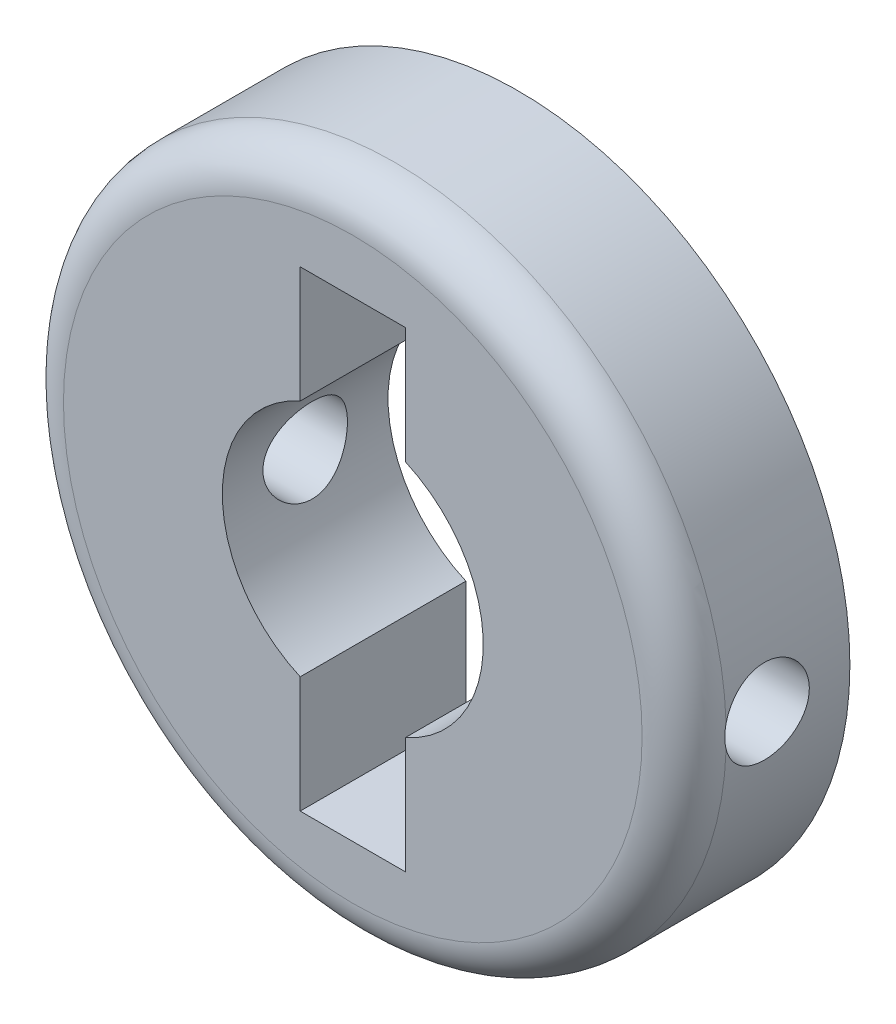
ISO-10303-21;
HEADER;
FILE_DESCRIPTION(('STEP AP214'),'2;1');
FILE_NAME('part.step','',(''),(''),'','','');
FILE_SCHEMA(('AUTOMOTIVE_DESIGN { 1 0 10303 214 1 1 1 1 }'));
ENDSEC;
DATA;
#1=APPLICATION_CONTEXT('core data for automotive mechanical design processes');
#2=APPLICATION_PROTOCOL_DEFINITION('international standard','automotive_design',2000,#1);
#3=PRODUCT_CONTEXT('',#1,'mechanical');
#4=PRODUCT('Part','Part','',(#3));
#5=PRODUCT_RELATED_PRODUCT_CATEGORY('part','',(#4));
#6=PRODUCT_DEFINITION_FORMATION('','',#4);
#7=PRODUCT_DEFINITION_CONTEXT('part definition',#1,'design');
#8=PRODUCT_DEFINITION('design','',#6,#7);
#9=PRODUCT_DEFINITION_SHAPE('','',#8);
#10=(LENGTH_UNIT() NAMED_UNIT(*) SI_UNIT(.MILLI.,.METRE.));
#11=(NAMED_UNIT(*) PLANE_ANGLE_UNIT() SI_UNIT($,.RADIAN.));
#12=(NAMED_UNIT(*) SI_UNIT($,.STERADIAN.) SOLID_ANGLE_UNIT());
#13=UNCERTAINTY_MEASURE_WITH_UNIT(LENGTH_MEASURE(1.E-05),#10,'distance_accuracy_value','');
#14=(GEOMETRIC_REPRESENTATION_CONTEXT(3) GLOBAL_UNCERTAINTY_ASSIGNED_CONTEXT((#13)) GLOBAL_UNIT_ASSIGNED_CONTEXT((#10,
#11,#12)) REPRESENTATION_CONTEXT('',''));
#15=CARTESIAN_POINT('',(0.,0.,0.));
#16=DIRECTION('',(0.,0.,1.));
#17=DIRECTION('',(1.,0.,0.));
#18=AXIS2_PLACEMENT_3D('',#15,#16,#17);
#19=CARTESIAN_POINT('',(0.,0.,2.5));
#20=DIRECTION('',(0.,0.,1.));
#21=DIRECTION('',(1.,0.,0.));
#22=AXIS2_PLACEMENT_3D('',#19,#20,#21);
#23=PLANE('',#22);
#24=CARTESIAN_POINT('',(0.,0.,2.5));
#25=DIRECTION('',(0.,0.,1.));
#26=DIRECTION('',(1.,0.,0.));
#27=AXIS2_PLACEMENT_3D('',#24,#25,#26);
#28=CIRCLE('',#27,8.73);
#29=CARTESIAN_POINT('',(8.73,0.,2.5));
#30=VERTEX_POINT('',#29);
#31=EDGE_CURVE('E188',#30,#30,#28,.T.);
#32=ORIENTED_EDGE('',*,*,#31,.T.);
#33=EDGE_LOOP('',(#32));
#34=FACE_BOUND('',#33,.T.);
#35=DIRECTION('',(0.,-1.,0.));
#36=VECTOR('',#35,1.);
#37=CARTESIAN_POINT('',(-1.5875,3.60275071993609,2.5));
#38=LINE('',#37,#36);
#39=CARTESIAN_POINT('',(-1.5875,7.112,2.5));
#40=VERTEX_POINT('',#39);
#41=CARTESIAN_POINT('',(-1.5875,3.60275071993609,2.5));
#42=VERTEX_POINT('',#41);
#43=EDGE_CURVE('E124',#40,#42,#38,.T.);
#44=ORIENTED_EDGE('',*,*,#43,.F.);
#45=DIRECTION('',(-1.,0.,0.));
#46=VECTOR('',#45,1.);
#47=CARTESIAN_POINT('',(1.5875,7.112,2.5));
#48=LINE('',#47,#46);
#49=CARTESIAN_POINT('',(1.5875,7.112,2.5));
#50=VERTEX_POINT('',#49);
#51=EDGE_CURVE('E114',#50,#40,#48,.T.);
#52=ORIENTED_EDGE('',*,*,#51,.F.);
#53=DIRECTION('',(0.,1.,0.));
#54=VECTOR('',#53,1.);
#55=CARTESIAN_POINT('',(1.5875,3.60275071993609,2.5));
#56=LINE('',#55,#54);
#57=CARTESIAN_POINT('',(1.5875,3.60275071993609,2.5));
#58=VERTEX_POINT('',#57);
#59=EDGE_CURVE('E151',#58,#50,#56,.T.);
#60=ORIENTED_EDGE('',*,*,#59,.F.);
#61=CARTESIAN_POINT('',(0.,0.,2.5));
#62=DIRECTION('',(0.,0.,1.));
#63=DIRECTION('',(1.,0.,0.));
#64=AXIS2_PLACEMENT_3D('',#61,#62,#63);
#65=CIRCLE('',#64,3.937);
#66=CARTESIAN_POINT('',(1.5875,-3.60275071993609,2.5));
#67=VERTEX_POINT('',#66);
#68=EDGE_CURVE('E148',#67,#58,#65,.T.);
#69=ORIENTED_EDGE('',*,*,#68,.F.);
#70=DIRECTION('',(0.,1.,0.));
#71=VECTOR('',#70,1.);
#72=CARTESIAN_POINT('',(1.5875,-3.60275071993609,2.5));
#73=LINE('',#72,#71);
#74=CARTESIAN_POINT('',(1.5875,-7.112,2.5));
#75=VERTEX_POINT('',#74);
#76=EDGE_CURVE('E146',#75,#67,#73,.T.);
#77=ORIENTED_EDGE('',*,*,#76,.F.);
#78=DIRECTION('',(1.,0.,0.));
#79=VECTOR('',#78,1.);
#80=CARTESIAN_POINT('',(1.5875,-7.112,2.5));
#81=LINE('',#80,#79);
#82=CARTESIAN_POINT('',(-1.5875,-7.112,2.5));
#83=VERTEX_POINT('',#82);
#84=EDGE_CURVE('E144',#83,#75,#81,.T.);
#85=ORIENTED_EDGE('',*,*,#84,.F.);
#86=DIRECTION('',(0.,-1.,0.));
#87=VECTOR('',#86,1.);
#88=CARTESIAN_POINT('',(-1.5875,-3.60275071993609,2.5));
#89=LINE('',#88,#87);
#90=CARTESIAN_POINT('',(-1.5875,-3.60275071993609,2.5));
#91=VERTEX_POINT('',#90);
#92=EDGE_CURVE('E139',#91,#83,#89,.T.);
#93=ORIENTED_EDGE('',*,*,#92,.F.);
#94=CARTESIAN_POINT('',(0.,0.,2.5));
#95=DIRECTION('',(0.,0.,1.));
#96=DIRECTION('',(1.,0.,0.));
#97=AXIS2_PLACEMENT_3D('',#94,#95,#96);
#98=CIRCLE('',#97,3.937);
#99=EDGE_CURVE('E137',#42,#91,#98,.T.);
#100=ORIENTED_EDGE('',*,*,#99,.F.);
#101=EDGE_LOOP('',(#44,#52,#60,#69,#77,#85,#93,#100));
#102=FACE_BOUND('',#101,.T.);
#103=ADVANCED_FACE('F32',(#34,#102),#23,.T.);
#104=CARTESIAN_POINT('',(0.,0.,-2.5));
#105=DIRECTION('',(0.,0.,1.));
#106=DIRECTION('',(1.,0.,0.));
#107=AXIS2_PLACEMENT_3D('',#104,#105,#106);
#108=PLANE('',#107);
#109=CARTESIAN_POINT('',(0.,0.,-2.5));
#110=DIRECTION('',(0.,0.,1.));
#111=DIRECTION('',(1.,0.,0.));
#112=AXIS2_PLACEMENT_3D('',#109,#110,#111);
#113=CIRCLE('',#112,10.);
#114=CARTESIAN_POINT('',(10.,0.,-2.5));
#115=VERTEX_POINT('',#114);
#116=EDGE_CURVE('E132',#115,#115,#113,.T.);
#117=ORIENTED_EDGE('',*,*,#116,.F.);
#118=EDGE_LOOP('',(#117));
#119=FACE_BOUND('',#118,.T.);
#120=DIRECTION('',(-1.,0.,0.));
#121=VECTOR('',#120,1.);
#122=CARTESIAN_POINT('',(1.5875,7.112,-2.5));
#123=LINE('',#122,#121);
#124=CARTESIAN_POINT('',(1.5875,7.112,-2.5));
#125=VERTEX_POINT('',#124);
#126=CARTESIAN_POINT('',(-1.5875,7.112,-2.5));
#127=VERTEX_POINT('',#126);
#128=EDGE_CURVE('E153',#125,#127,#123,.T.);
#129=ORIENTED_EDGE('',*,*,#128,.T.);
#130=DIRECTION('',(0.,-1.,0.));
#131=VECTOR('',#130,1.);
#132=CARTESIAN_POINT('',(-1.5875,3.60275071993609,-2.5));
#133=LINE('',#132,#131);
#134=CARTESIAN_POINT('',(-1.5875,3.60275071993609,-2.5));
#135=VERTEX_POINT('',#134);
#136=EDGE_CURVE('E131',#127,#135,#133,.T.);
#137=ORIENTED_EDGE('',*,*,#136,.T.);
#138=CARTESIAN_POINT('',(0.,0.,-2.5));
#139=DIRECTION('',(0.,0.,1.));
#140=DIRECTION('',(1.,0.,0.));
#141=AXIS2_PLACEMENT_3D('',#138,#139,#140);
#142=CIRCLE('',#141,3.937);
#143=CARTESIAN_POINT('',(-1.5875,-3.60275071993609,-2.5));
#144=VERTEX_POINT('',#143);
#145=EDGE_CURVE('E157',#135,#144,#142,.T.);
#146=ORIENTED_EDGE('',*,*,#145,.T.);
#147=DIRECTION('',(0.,-1.,0.));
#148=VECTOR('',#147,1.);
#149=CARTESIAN_POINT('',(-1.5875,-3.60275071993609,-2.5));
#150=LINE('',#149,#148);
#151=CARTESIAN_POINT('',(-1.5875,-7.112,-2.5));
#152=VERTEX_POINT('',#151);
#153=EDGE_CURVE('E160',#144,#152,#150,.T.);
#154=ORIENTED_EDGE('',*,*,#153,.T.);
#155=DIRECTION('',(1.,0.,0.));
#156=VECTOR('',#155,1.);
#157=CARTESIAN_POINT('',(1.5875,-7.112,-2.5));
#158=LINE('',#157,#156);
#159=CARTESIAN_POINT('',(1.5875,-7.112,-2.5));
#160=VERTEX_POINT('',#159);
#161=EDGE_CURVE('E163',#152,#160,#158,.T.);
#162=ORIENTED_EDGE('',*,*,#161,.T.);
#163=DIRECTION('',(0.,1.,0.));
#164=VECTOR('',#163,1.);
#165=CARTESIAN_POINT('',(1.5875,-3.60275071993609,-2.5));
#166=LINE('',#165,#164);
#167=CARTESIAN_POINT('',(1.5875,-3.60275071993609,-2.5));
#168=VERTEX_POINT('',#167);
#169=EDGE_CURVE('E166',#160,#168,#166,.T.);
#170=ORIENTED_EDGE('',*,*,#169,.T.);
#171=CARTESIAN_POINT('',(0.,0.,-2.5));
#172=DIRECTION('',(0.,0.,1.));
#173=DIRECTION('',(1.,0.,0.));
#174=AXIS2_PLACEMENT_3D('',#171,#172,#173);
#175=CIRCLE('',#174,3.937);
#176=CARTESIAN_POINT('',(1.5875,3.60275071993609,-2.5));
#177=VERTEX_POINT('',#176);
#178=EDGE_CURVE('E169',#168,#177,#175,.T.);
#179=ORIENTED_EDGE('',*,*,#178,.T.);
#180=DIRECTION('',(0.,1.,0.));
#181=VECTOR('',#180,1.);
#182=CARTESIAN_POINT('',(1.5875,3.60275071993609,-2.5));
#183=LINE('',#182,#181);
#184=EDGE_CURVE('E125',#177,#125,#183,.T.);
#185=ORIENTED_EDGE('',*,*,#184,.T.);
#186=EDGE_LOOP('',(#129,#137,#146,#154,#162,#170,#179,#185));
#187=FACE_BOUND('',#186,.T.);
#188=ADVANCED_FACE('F244',(#119,#187),#108,.F.);
#189=CARTESIAN_POINT('',(0.,0.,2.5));
#190=DIRECTION('',(0.,0.,-1.));
#191=DIRECTION('',(-1.,0.,0.));
#192=AXIS2_PLACEMENT_3D('',#189,#190,#191);
#193=CYLINDRICAL_SURFACE('',#192,10.);
#194=CARTESIAN_POINT('',(-10.,0.,-1.275));
#195=CARTESIAN_POINT('',(-9.99999898900905,0.0713069805486591,-1.27499697797855));
#196=CARTESIAN_POINT('',(-9.99922924783354,0.142658227813307,-1.26899784548031));
#197=CARTESIAN_POINT('',(-9.99623264213217,0.283374441484481,-1.24516129443431));
#198=CARTESIAN_POINT('',(-9.99400426560893,0.352737268766622,-1.22731159150624));
#199=CARTESIAN_POINT('',(-9.98834137101106,0.487419180533232,-1.18030904834373));
#200=CARTESIAN_POINT('',(-9.98490767419184,0.552740982848698,-1.15116390295317));
#201=CARTESIAN_POINT('',(-9.97721580740441,0.677554145862685,-1.08241481650949));
#202=CARTESIAN_POINT('',(-9.97295777640154,0.737046486742956,-1.04281263788257));
#203=CARTESIAN_POINT('',(-9.96406524675019,0.848864327094692,-0.954031627322279));
#204=CARTESIAN_POINT('',(-9.95942893703471,0.901151685479557,-0.904804934010639));
#205=CARTESIAN_POINT('',(-9.95031695365,0.996746776968978,-0.798275048334957));
#206=CARTESIAN_POINT('',(-9.94584128826959,1.04005404727433,-0.740971439973291));
#207=CARTESIAN_POINT('',(-9.93753954596834,1.11660231342159,-0.619665690952453));
#208=CARTESIAN_POINT('',(-9.93371580295591,1.14980746269953,-0.55564075633708));
#209=CARTESIAN_POINT('',(-9.92717481478011,1.20497997499278,-0.4228663327161));
#210=CARTESIAN_POINT('',(-9.92445752599503,1.22694778104649,-0.354117030092527));
#211=CARTESIAN_POINT('',(-9.92045445625584,1.25890587413019,-0.214241798782247));
#212=CARTESIAN_POINT('',(-9.91916097019215,1.26896065302708,-0.143130829293696));
#213=CARTESIAN_POINT('',(-9.91812839760472,1.27700685454378,-0.000219965706401109));
#214=CARTESIAN_POINT('',(-9.91838924613034,1.27499878123146,0.071579899480426));
#215=CARTESIAN_POINT('',(-9.92042881906909,1.25902919836005,0.213380403993893));
#216=CARTESIAN_POINT('',(-9.92219851323609,1.24513880133326,0.28338920038705));
#217=CARTESIAN_POINT('',(-9.92704229069485,1.2059098549359,0.420074007332438));
#218=CARTESIAN_POINT('',(-9.93011640138931,1.18057106506112,0.486749947836406));
#219=CARTESIAN_POINT('',(-9.93723285099178,1.11908840190083,0.615096855854847));
#220=CARTESIAN_POINT('',(-9.94127794592848,1.0829136983135,0.676752895526141));
#221=CARTESIAN_POINT('',(-9.94987846550756,1.0008081207522,0.79314621012636));
#222=CARTESIAN_POINT('',(-9.95443391442528,0.954876782603902,0.847883155679958));
#223=CARTESIAN_POINT('',(-9.96358197658719,0.854167995700556,0.949297204865434));
#224=CARTESIAN_POINT('',(-9.96817462136311,0.799329265711963,0.995913472158784));
#225=CARTESIAN_POINT('',(-9.97684894799018,0.682573166986681,1.07928897096873));
#226=CARTESIAN_POINT('',(-9.98093062858055,0.620655780784414,1.11604817816368));
#227=CARTESIAN_POINT('',(-9.98812581159269,0.491452526058853,1.17866642593481));
#228=CARTESIAN_POINT('',(-9.9912389683406,0.42416475154302,1.20452157593427));
#229=CARTESIAN_POINT('',(-9.99614322590008,0.286154206703742,1.2445490595542));
#230=CARTESIAN_POINT('',(-9.99793439112089,0.215431603908774,1.25872196235361));
#231=CARTESIAN_POINT('',(-9.99998446286045,0.0730848890533081,1.27490359799768));
#232=CARTESIAN_POINT('',(-10.0002539236369,0.00147044803292541,1.27699612036947));
#233=CARTESIAN_POINT('',(-9.99925874312059,-0.141088112456314,1.2691788358716));
#234=CARTESIAN_POINT('',(-9.99799413584901,-0.212032246755497,1.25926929517345));
#235=CARTESIAN_POINT('',(-9.99407948503002,-0.350988509681615,1.22779879492626));
#236=CARTESIAN_POINT('',(-9.99143420260153,-0.419009850253013,1.20627786752556));
#237=CARTESIAN_POINT('',(-9.98505430711499,-0.550478067403917,1.15223716900696));
#238=CARTESIAN_POINT('',(-9.98131965571461,-0.613924782873023,1.11971701074446));
#239=CARTESIAN_POINT('',(-9.9731509550182,-0.734816409736119,1.04439882264762));
#240=CARTESIAN_POINT('',(-9.96871326764595,-0.79222736312898,1.00154668893418));
#241=CARTESIAN_POINT('',(-9.95964607645321,-0.8990720945148,0.906857394221863));
#242=CARTESIAN_POINT('',(-9.95501656470518,-0.94850554240706,0.855019861600713));
#243=CARTESIAN_POINT('',(-9.94605485241221,-1.03829001597882,0.743461787929181));
#244=CARTESIAN_POINT('',(-9.94172457787171,-1.07858544038074,0.683696320349539));
#245=CARTESIAN_POINT('',(-9.93388353426127,-1.14856569467084,0.558196517882709));
#246=CARTESIAN_POINT('',(-9.93037274820726,-1.17825074446811,0.492462306738243));
#247=CARTESIAN_POINT('',(-9.92458138375427,-1.22607793517766,0.357069116795437));
#248=CARTESIAN_POINT('',(-9.92229748747524,-1.24425123146653,0.287421291523409));
#249=CARTESIAN_POINT('',(-9.91920904111565,-1.26863927281101,0.146031489717073));
#250=CARTESIAN_POINT('',(-9.91840441920459,-1.27485459852161,0.0742896150373353));
#251=CARTESIAN_POINT('',(-9.9183677729374,-1.27513932373651,-0.0686985515129803));
#252=CARTESIAN_POINT('',(-9.9191244380328,-1.26929607999485,-0.139944682277638));
#253=CARTESIAN_POINT('',(-9.92210076718944,-1.24581472558366,-0.280433285345764));
#254=CARTESIAN_POINT('',(-9.92432043120827,-1.22817661525598,-0.349675757707303));
#255=CARTESIAN_POINT('',(-9.92996911718717,-1.18163386105255,-0.484178827192298));
#256=CARTESIAN_POINT('',(-9.93339766837658,-1.15273360247657,-0.549440962769689));
#257=CARTESIAN_POINT('',(-9.94107857339484,-1.0844955146534,-0.674203543399463));
#258=CARTESIAN_POINT('',(-9.94533093919083,-1.04515753377961,-0.733703904734617));
#259=CARTESIAN_POINT('',(-9.95421722928982,-0.956837148581513,-0.845700266674065));
#260=CARTESIAN_POINT('',(-9.95885359819787,-0.907789667172023,-0.898144757314406));
#261=CARTESIAN_POINT('',(-9.96796401397538,-0.801578592860974,-0.994092054393632));
#262=CARTESIAN_POINT('',(-9.97243802237438,-0.744413092000531,-1.03759275289427));
#263=CARTESIAN_POINT('',(-9.98073922773195,-0.623328718537295,-1.11456486983362));
#264=CARTESIAN_POINT('',(-9.98456379789354,-0.55938404277058,-1.14799596217558));
#265=CARTESIAN_POINT('',(-9.99110868721096,-0.426774569315059,-1.20359737207436));
#266=CARTESIAN_POINT('',(-9.99383020045368,-0.358114970350297,-1.22577987308476));
#267=CARTESIAN_POINT('',(-9.99720946932226,-0.240920269612237,-1.25296998562738));
#268=CARTESIAN_POINT('',(-9.99825079504399,-0.193122868681685,-1.26121929976254));
#269=CARTESIAN_POINT('',(-9.99964640120901,-0.0968904554644047,-1.27223531238636));
#270=CARTESIAN_POINT('',(-10.0000006870017,-0.0484554481451583,-1.27500205356338));
#271=CARTESIAN_POINT('',(-10.,0.,-1.275));
#272=B_SPLINE_CURVE_WITH_KNOTS('',3,(#194,#195,#196,#197,#198,#199,#200,#201,#202,#203,#204,
#205,#206,#207,#208,#209,#210,#211,#212,#213,#214,#215,#216,#217,#218,#219,#220,#221,#222,#223,
#224,#225,#226,#227,#228,#229,#230,#231,#232,#233,#234,#235,#236,#237,#238,#239,#240,#241,#242,
#243,#244,#245,#246,#247,#248,#249,#250,#251,#252,#253,#254,#255,#256,#257,#258,#259,#260,#261,
#262,#263,#264,#265,#266,#267,#268,#269,#270,#271),.UNSPECIFIED.,.T.,.F.,(4,2,2,2,2,2,2,2,2,2,2,
2,2,2,2,2,2,2,2,2,2,2,2,2,2,2,2,2,2,2,2,2,2,2,2,2,2,2,4),(0.,0.213743942986407,
0.427709801042754,0.641530153687137,0.855314492070391,1.07019030756699,1.28507719418589,
1.50071792744131,1.71635015828748,1.93080963875363,2.14526015770868,2.3584361553852,
2.57161663160371,2.78540950426986,2.99921255046427,3.21455420323894,3.42989638735001,
3.64531534086124,3.86072379817436,4.07463637031165,4.28854419856527,4.50171921374736,
4.7149017329222,4.92922581068809,5.1435587546838,5.35916278595556,5.57476234839047,
5.78977589133864,6.00477899339806,6.21823000200924,6.43168100443406,6.64504897538037,
6.85842004604822,7.07327283701176,7.28817620814823,7.5039291047754,7.7194478156189,
7.86469501454714,8.00994108254818),.UNSPECIFIED.);
#273=CARTESIAN_POINT('',(-9.99436216073842,-0.335745439283992,1.23));
#274=VERTEX_POINT('',#273);
#275=CARTESIAN_POINT('',(-9.99436216073842,0.335745439283991,1.23));
#276=VERTEX_POINT('',#275);
#277=EDGE_CURVE('E155',#274,#276,#272,.T.);
#278=ORIENTED_EDGE('',*,*,#277,.T.);
#279=CARTESIAN_POINT('',(0.,0.,1.23));
#280=DIRECTION('',(0.,0.,1.));
#281=DIRECTION('',(1.,0.,0.));
#282=AXIS2_PLACEMENT_3D('',#279,#280,#281);
#283=CIRCLE('',#282,10.);
#284=CARTESIAN_POINT('',(9.99436216073842,0.335745439283992,1.23));
#285=VERTEX_POINT('',#284);
#286=EDGE_CURVE('E231',#276,#285,#283,.F.);
#287=ORIENTED_EDGE('',*,*,#286,.T.);
#288=CARTESIAN_POINT('',(10.,0.,-1.275));
#289=CARTESIAN_POINT('',(9.99999898900905,-0.0713069805486591,-1.27499697797855));
#290=CARTESIAN_POINT('',(9.99922924783354,-0.142658227813307,-1.26899784548031));
#291=CARTESIAN_POINT('',(9.99623264213217,-0.283374441484481,-1.24516129443431));
#292=CARTESIAN_POINT('',(9.99400426560893,-0.352737268766622,-1.22731159150624));
#293=CARTESIAN_POINT('',(9.98834137101106,-0.487419180533232,-1.18030904834373));
#294=CARTESIAN_POINT('',(9.98490767419184,-0.552740982848698,-1.15116390295317));
#295=CARTESIAN_POINT('',(9.97721580740441,-0.677554145862685,-1.08241481650949));
#296=CARTESIAN_POINT('',(9.97295777640154,-0.737046486742956,-1.04281263788257));
#297=CARTESIAN_POINT('',(9.96406524675019,-0.848864327094692,-0.954031627322279));
#298=CARTESIAN_POINT('',(9.95942893703471,-0.901151685479557,-0.904804934010639));
#299=CARTESIAN_POINT('',(9.95031695365,-0.996746776968978,-0.798275048334957));
#300=CARTESIAN_POINT('',(9.94584128826959,-1.04005404727433,-0.740971439973291));
#301=CARTESIAN_POINT('',(9.93753954596834,-1.11660231342159,-0.619665690952453));
#302=CARTESIAN_POINT('',(9.93371580295591,-1.14980746269953,-0.55564075633708));
#303=CARTESIAN_POINT('',(9.92717481478011,-1.20497997499278,-0.4228663327161));
#304=CARTESIAN_POINT('',(9.92445752599503,-1.22694778104649,-0.354117030092527));
#305=CARTESIAN_POINT('',(9.92045445625584,-1.25890587413019,-0.214241798782247));
#306=CARTESIAN_POINT('',(9.91916097019215,-1.26896065302708,-0.143130829293696));
#307=CARTESIAN_POINT('',(9.91812839760472,-1.27700685454378,-0.000219965706401109));
#308=CARTESIAN_POINT('',(9.91838924613034,-1.27499878123146,0.071579899480426));
#309=CARTESIAN_POINT('',(9.92042881906909,-1.25902919836005,0.213380403993893));
#310=CARTESIAN_POINT('',(9.92219851323609,-1.24513880133326,0.28338920038705));
#311=CARTESIAN_POINT('',(9.92704229069485,-1.2059098549359,0.420074007332438));
#312=CARTESIAN_POINT('',(9.93011640138931,-1.18057106506112,0.486749947836406));
#313=CARTESIAN_POINT('',(9.93723285099178,-1.11908840190083,0.615096855854847));
#314=CARTESIAN_POINT('',(9.94127794592848,-1.0829136983135,0.676752895526141));
#315=CARTESIAN_POINT('',(9.94987846550756,-1.0008081207522,0.79314621012636));
#316=CARTESIAN_POINT('',(9.95443391442528,-0.954876782603902,0.847883155679958));
#317=CARTESIAN_POINT('',(9.96358197658719,-0.854167995700556,0.949297204865434));
#318=CARTESIAN_POINT('',(9.96817462136311,-0.799329265711963,0.995913472158784));
#319=CARTESIAN_POINT('',(9.97684894799018,-0.682573166986681,1.07928897096873));
#320=CARTESIAN_POINT('',(9.98093062858055,-0.620655780784414,1.11604817816368));
#321=CARTESIAN_POINT('',(9.98812581159269,-0.491452526058853,1.17866642593481));
#322=CARTESIAN_POINT('',(9.9912389683406,-0.42416475154302,1.20452157593427));
#323=CARTESIAN_POINT('',(9.99614322590008,-0.286154206703742,1.2445490595542));
#324=CARTESIAN_POINT('',(9.99793439112089,-0.215431603908774,1.25872196235361));
#325=CARTESIAN_POINT('',(9.99998446286045,-0.0730848890533081,1.27490359799768));
#326=CARTESIAN_POINT('',(10.0002539236369,-0.00147044803292541,1.27699612036947));
#327=CARTESIAN_POINT('',(9.99925874312059,0.141088112456314,1.2691788358716));
#328=CARTESIAN_POINT('',(9.99799413584901,0.212032246755497,1.25926929517345));
#329=CARTESIAN_POINT('',(9.99407948503002,0.350988509681615,1.22779879492626));
#330=CARTESIAN_POINT('',(9.99143420260153,0.419009850253013,1.20627786752556));
#331=CARTESIAN_POINT('',(9.98505430711499,0.550478067403917,1.15223716900696));
#332=CARTESIAN_POINT('',(9.98131965571461,0.613924782873023,1.11971701074446));
#333=CARTESIAN_POINT('',(9.9731509550182,0.734816409736119,1.04439882264762));
#334=CARTESIAN_POINT('',(9.96871326764595,0.79222736312898,1.00154668893418));
#335=CARTESIAN_POINT('',(9.95964607645321,0.8990720945148,0.906857394221863));
#336=CARTESIAN_POINT('',(9.95501656470518,0.94850554240706,0.855019861600713));
#337=CARTESIAN_POINT('',(9.94605485241221,1.03829001597882,0.743461787929181));
#338=CARTESIAN_POINT('',(9.94172457787171,1.07858544038074,0.683696320349539));
#339=CARTESIAN_POINT('',(9.93388353426127,1.14856569467084,0.558196517882709));
#340=CARTESIAN_POINT('',(9.93037274820726,1.17825074446811,0.492462306738243));
#341=CARTESIAN_POINT('',(9.92458138375427,1.22607793517766,0.357069116795437));
#342=CARTESIAN_POINT('',(9.92229748747524,1.24425123146653,0.287421291523409));
#343=CARTESIAN_POINT('',(9.91920904111565,1.26863927281101,0.146031489717073));
#344=CARTESIAN_POINT('',(9.91840441920459,1.27485459852161,0.0742896150373353));
#345=CARTESIAN_POINT('',(9.9183677729374,1.27513932373651,-0.0686985515129803));
#346=CARTESIAN_POINT('',(9.9191244380328,1.26929607999485,-0.139944682277638));
#347=CARTESIAN_POINT('',(9.92210076718944,1.24581472558366,-0.280433285345764));
#348=CARTESIAN_POINT('',(9.92432043120827,1.22817661525598,-0.349675757707303));
#349=CARTESIAN_POINT('',(9.92996911718717,1.18163386105255,-0.484178827192298));
#350=CARTESIAN_POINT('',(9.93339766837658,1.15273360247657,-0.549440962769689));
#351=CARTESIAN_POINT('',(9.94107857339484,1.0844955146534,-0.674203543399463));
#352=CARTESIAN_POINT('',(9.94533093919083,1.04515753377961,-0.733703904734617));
#353=CARTESIAN_POINT('',(9.95421722928982,0.956837148581513,-0.845700266674065));
#354=CARTESIAN_POINT('',(9.95885359819787,0.907789667172023,-0.898144757314406));
#355=CARTESIAN_POINT('',(9.96796401397538,0.801578592860974,-0.994092054393632));
#356=CARTESIAN_POINT('',(9.97243802237438,0.744413092000531,-1.03759275289427));
#357=CARTESIAN_POINT('',(9.98073922773195,0.623328718537295,-1.11456486983362));
#358=CARTESIAN_POINT('',(9.98456379789354,0.55938404277058,-1.14799596217558));
#359=CARTESIAN_POINT('',(9.99110868721096,0.426774569315059,-1.20359737207436));
#360=CARTESIAN_POINT('',(9.99383020045368,0.358114970350297,-1.22577987308476));
#361=CARTESIAN_POINT('',(9.99720946932226,0.240920269612237,-1.25296998562738));
#362=CARTESIAN_POINT('',(9.99825079504399,0.193122868681685,-1.26121929976254));
#363=CARTESIAN_POINT('',(9.99964640120901,0.0968904554644047,-1.27223531238636));
#364=CARTESIAN_POINT('',(10.0000006870017,0.0484554481451583,-1.27500205356338));
#365=CARTESIAN_POINT('',(10.,0.,-1.275));
#366=B_SPLINE_CURVE_WITH_KNOTS('',3,(#288,#289,#290,#291,#292,#293,#294,#295,#296,#297,#298,
#299,#300,#301,#302,#303,#304,#305,#306,#307,#308,#309,#310,#311,#312,#313,#314,#315,#316,#317,
#318,#319,#320,#321,#322,#323,#324,#325,#326,#327,#328,#329,#330,#331,#332,#333,#334,#335,#336,
#337,#338,#339,#340,#341,#342,#343,#344,#345,#346,#347,#348,#349,#350,#351,#352,#353,#354,#355,
#356,#357,#358,#359,#360,#361,#362,#363,#364,#365),.UNSPECIFIED.,.T.,.F.,(4,2,2,2,2,2,2,2,2,2,2,
2,2,2,2,2,2,2,2,2,2,2,2,2,2,2,2,2,2,2,2,2,2,2,2,2,2,2,4),(0.,0.213743942986407,
0.427709801042754,0.641530153687137,0.855314492070391,1.07019030756699,1.28507719418589,
1.50071792744131,1.71635015828748,1.93080963875363,2.14526015770868,2.3584361553852,
2.57161663160371,2.78540950426986,2.99921255046427,3.21455420323894,3.42989638735001,
3.64531534086124,3.86072379817436,4.07463637031165,4.28854419856527,4.50171921374736,
4.7149017329222,4.92922581068809,5.1435587546838,5.35916278595556,5.57476234839047,
5.78977589133864,6.00477899339806,6.21823000200924,6.43168100443406,6.64504897538037,
6.85842004604822,7.07327283701176,7.28817620814823,7.5039291047754,7.7194478156189,
7.86469501454714,8.00994108254818),.UNSPECIFIED.);
#367=CARTESIAN_POINT('',(9.99436216073842,-0.33574543928399,1.23));
#368=VERTEX_POINT('',#367);
#369=EDGE_CURVE('E219',#285,#368,#366,.T.);
#370=ORIENTED_EDGE('',*,*,#369,.T.);
#371=CARTESIAN_POINT('',(0.,0.,1.23));
#372=DIRECTION('',(0.,0.,1.));
#373=DIRECTION('',(1.,0.,0.));
#374=AXIS2_PLACEMENT_3D('',#371,#372,#373);
#375=CIRCLE('',#374,10.);
#376=EDGE_CURVE('E232',#368,#274,#375,.F.);
#377=ORIENTED_EDGE('',*,*,#376,.T.);
#378=EDGE_LOOP('',(#278,#287,#370,#377));
#379=FACE_BOUND('',#378,.T.);
#380=ORIENTED_EDGE('',*,*,#116,.T.);
#381=EDGE_LOOP('',(#380));
#382=FACE_BOUND('',#381,.T.);
#383=ADVANCED_FACE('F249',(#379,#382),#193,.T.);
#384=CARTESIAN_POINT('',(1.5875,7.112,2.5));
#385=DIRECTION('',(0.,-1.,0.));
#386=DIRECTION('',(0.,0.,-1.));
#387=AXIS2_PLACEMENT_3D('',#384,#385,#386);
#388=PLANE('',#387);
#389=ORIENTED_EDGE('',*,*,#128,.F.);
#390=DIRECTION('',(0.,0.,-1.));
#391=VECTOR('',#390,1.);
#392=CARTESIAN_POINT('',(1.5875,7.112,2.5));
#393=LINE('',#392,#391);
#394=EDGE_CURVE('E120',#50,#125,#393,.T.);
#395=ORIENTED_EDGE('',*,*,#394,.F.);
#396=ORIENTED_EDGE('',*,*,#51,.T.);
#397=DIRECTION('',(0.,0.,-1.));
#398=VECTOR('',#397,1.);
#399=CARTESIAN_POINT('',(-1.5875,7.112,2.5));
#400=LINE('',#399,#398);
#401=EDGE_CURVE('E117',#40,#127,#400,.T.);
#402=ORIENTED_EDGE('',*,*,#401,.T.);
#403=EDGE_LOOP('',(#389,#395,#396,#402));
#404=FACE_BOUND('',#403,.T.);
#405=ADVANCED_FACE('F116',(#404),#388,.T.);
#406=CARTESIAN_POINT('',(-1.5875,3.60275071993609,2.5));
#407=DIRECTION('',(1.,0.,0.));
#408=DIRECTION('',(0.,0.,-1.));
#409=AXIS2_PLACEMENT_3D('',#406,#407,#408);
#410=PLANE('',#409);
#411=ORIENTED_EDGE('',*,*,#136,.F.);
#412=ORIENTED_EDGE('',*,*,#401,.F.);
#413=ORIENTED_EDGE('',*,*,#43,.T.);
#414=DIRECTION('',(0.,0.,-1.));
#415=VECTOR('',#414,1.);
#416=CARTESIAN_POINT('',(-1.5875,3.60275071993609,2.5));
#417=LINE('',#416,#415);
#418=EDGE_CURVE('E133',#42,#135,#417,.T.);
#419=ORIENTED_EDGE('',*,*,#418,.T.);
#420=EDGE_LOOP('',(#411,#412,#413,#419));
#421=FACE_BOUND('',#420,.T.);
#422=ADVANCED_FACE('F128',(#421),#410,.T.);
#423=CARTESIAN_POINT('',(0.,0.,2.5));
#424=DIRECTION('',(0.,0.,-1.));
#425=DIRECTION('',(-1.,0.,0.));
#426=AXIS2_PLACEMENT_3D('',#423,#424,#425);
#427=CYLINDRICAL_SURFACE('',#426,3.937);
#428=CARTESIAN_POINT('',(-3.937,0.,-1.275));
#429=CARTESIAN_POINT('',(-3.93699992777024,0.0696790348507789,-1.27499994813984));
#430=CARTESIAN_POINT('',(-3.93513293189144,0.13935924059506,-1.26926934011207));
#431=CARTESIAN_POINT('',(-3.92786855394358,0.276673973711425,-1.24656379528632));
#432=CARTESIAN_POINT('',(-3.9224706072913,0.344308172126367,-1.22958706027752));
#433=CARTESIAN_POINT('',(-3.90873232264138,0.475531243666717,-1.18502747206445));
#434=CARTESIAN_POINT('',(-3.90039673799819,0.53912645718287,-1.15746174632432));
#435=CARTESIAN_POINT('',(-3.88163852296577,0.660791539756678,-1.09258198692755));
#436=CARTESIAN_POINT('',(-3.87121551816735,0.71886041482469,-1.05526620408986));
#437=CARTESIAN_POINT('',(-3.84900009546469,0.829735656589529,-0.970654416194698));
#438=CARTESIAN_POINT('',(-3.8371762283957,0.882334834042017,-0.923095207940707));
#439=CARTESIAN_POINT('',(-3.81366889904217,0.978967086144833,-0.819906559839645));
#440=CARTESIAN_POINT('',(-3.80198546586107,1.02299841296659,-0.764275477374584));
#441=CARTESIAN_POINT('',(-3.77973981034261,1.10240020680078,-0.644690176892556));
#442=CARTESIAN_POINT('',(-3.76921614296148,1.13750621256714,-0.580552504203202));
#443=CARTESIAN_POINT('',(-3.7509573396324,1.19634613833028,-0.446887618827976));
#444=CARTESIAN_POINT('',(-3.74322140712969,1.220083307446,-0.377361952593091));
#445=CARTESIAN_POINT('',(-3.73174409976226,1.25474331370062,-0.237242602760693));
#446=CARTESIAN_POINT('',(-3.72788260002106,1.26605261472115,-0.166754638192533));
#447=CARTESIAN_POINT('',(-3.72423542632,1.27674366491836,-0.0247840838758941));
#448=CARTESIAN_POINT('',(-3.72444857555208,1.27612885792137,0.0466982127377101));
#449=CARTESIAN_POINT('',(-3.72882099262532,1.26329022192821,0.185378814769557));
#450=CARTESIAN_POINT('',(-3.73281090183053,1.25156460387626,0.252629496464199));
#451=CARTESIAN_POINT('',(-3.74401107609835,1.21764764317369,0.384152161059051));
#452=CARTESIAN_POINT('',(-3.75122170657451,1.195455112962,0.448423805052849));
#453=CARTESIAN_POINT('',(-3.76817572548867,1.14089638173124,0.573321184216334));
#454=CARTESIAN_POINT('',(-3.77795647205052,1.10837850763456,0.633875374523725));
#455=CARTESIAN_POINT('',(-3.79893235217164,1.03419745228398,0.748827868208175));
#456=CARTESIAN_POINT('',(-3.81012787521024,0.992531750350895,0.803224468590855));
#457=CARTESIAN_POINT('',(-3.83334423018112,0.898820953131841,0.907125222133637));
#458=CARTESIAN_POINT('',(-3.8453785947778,0.846366684069255,0.956258026595923));
#459=CARTESIAN_POINT('',(-3.86843398442121,0.733814157610845,1.04512362306933));
#460=CARTESIAN_POINT('',(-3.87945492283378,0.673715247746784,1.08485561189427));
#461=CARTESIAN_POINT('',(-3.89937257741883,0.546825182871751,1.15406855555275));
#462=CARTESIAN_POINT('',(-3.90824950453338,0.479979201845353,1.18345507937187));
#463=CARTESIAN_POINT('',(-3.92273570815668,0.341937220615448,1.23045324473874));
#464=CARTESIAN_POINT('',(-3.92834605336611,0.270742651535587,1.24806873759648));
#465=CARTESIAN_POINT('',(-3.93549225858869,0.129172044183437,1.27037864738189));
#466=CARTESIAN_POINT('',(-3.93718638947711,0.0588830266079456,1.27557527423606));
#467=CARTESIAN_POINT('',(-3.93678091699107,-0.0815734969147492,1.27432377143132));
#468=CARTESIAN_POINT('',(-3.93468191369827,-0.151741020324782,1.26787748370562));
#469=CARTESIAN_POINT('',(-3.92703029889904,-0.287986479856375,1.24392330111961));
#470=CARTESIAN_POINT('',(-3.92157263108654,-0.354123696552622,1.22671930029941));
#471=CARTESIAN_POINT('',(-3.90784961672232,-0.482550234568851,1.18211376436863));
#472=CARTESIAN_POINT('',(-3.89958391662722,-0.544839070193367,1.15471094514127));
#473=CARTESIAN_POINT('',(-3.88082722747036,-0.66556621228015,1.08970925989223));
#474=CARTESIAN_POINT('',(-3.87028495135417,-0.723866150262875,1.05186861840948));
#475=CARTESIAN_POINT('',(-3.84817530784961,-0.833454378850902,0.967352214279806));
#476=CARTESIAN_POINT('',(-3.8366076438008,-0.884740629304658,0.92067389029));
#477=CARTESIAN_POINT('',(-3.81312618730611,-0.981124558319999,0.817444551910496));
#478=CARTESIAN_POINT('',(-3.80121873649199,-1.02586397963559,0.760556805935127));
#479=CARTESIAN_POINT('',(-3.77891592317048,-1.10520020094839,0.639823663165894));
#480=CARTESIAN_POINT('',(-3.76852055482964,-1.13979704007497,0.575978293215347));
#481=CARTESIAN_POINT('',(-3.75052776618427,-1.19767773414489,0.443193792057435));
#482=CARTESIAN_POINT('',(-3.74292209763391,-1.22099500540934,0.374270412584747));
#483=CARTESIAN_POINT('',(-3.73145855533511,-1.25559738111461,0.233175185784081));
#484=CARTESIAN_POINT('',(-3.72759911679162,-1.26688750946848,0.161004707956803));
#485=CARTESIAN_POINT('',(-3.72423616847469,-1.27673728842926,0.0192317799370761));
#486=CARTESIAN_POINT('',(-3.72453030204852,-1.27588831401705,-0.0503252644401373));
#487=CARTESIAN_POINT('',(-3.72894506450552,-1.26292656536536,-0.188251784557268));
#488=CARTESIAN_POINT('',(-3.73306548926172,-1.25081439200083,-0.256621323450634));
#489=CARTESIAN_POINT('',(-3.74452209357559,-1.2160784352064,-0.389088403933921));
#490=CARTESIAN_POINT('',(-3.75180272937652,-1.19363582461495,-0.453238627331496));
#491=CARTESIAN_POINT('',(-3.76874174213904,-1.13902078392478,-0.576913374881615));
#492=CARTESIAN_POINT('',(-3.77840062729832,-1.10684627392292,-0.636436906795297));
#493=CARTESIAN_POINT('',(-3.79950872132185,-1.03211797282884,-0.751849730935032));
#494=CARTESIAN_POINT('',(-3.81101567394076,-0.989188227424473,-0.807484990089956));
#495=CARTESIAN_POINT('',(-3.83427082550733,-0.894815578169712,-0.910953155893648));
#496=CARTESIAN_POINT('',(-3.84601909014147,-0.843370328714838,-0.958783905553557));
#497=CARTESIAN_POINT('',(-3.8689406945184,-0.731201115196461,-1.0470154365348));
#498=CARTESIAN_POINT('',(-3.88007811445817,-0.670209803179143,-1.08708677517209));
#499=CARTESIAN_POINT('',(-3.90005218616971,-0.541998311188727,-1.15635956694874));
#500=CARTESIAN_POINT('',(-3.90888957475356,-0.474780135363023,-1.1855645024176));
#501=CARTESIAN_POINT('',(-3.92280084062833,-0.340401194637638,-1.23063099346558));
#502=CARTESIAN_POINT('',(-3.92807711643293,-0.273504787392049,-1.24721862746623));
#503=CARTESIAN_POINT('',(-3.93517631733961,-0.137738982964166,-1.26940183707825));
#504=CARTESIAN_POINT('',(-3.93700007139117,-0.06887006341371,-1.27500005125806));
#505=CARTESIAN_POINT('',(-3.937,0.,-1.275));
#506=B_SPLINE_CURVE_WITH_KNOTS('',3,(#428,#429,#430,#431,#432,#433,#434,#435,#436,#437,#438,
#439,#440,#441,#442,#443,#444,#445,#446,#447,#448,#449,#450,#451,#452,#453,#454,#455,#456,#457,
#458,#459,#460,#461,#462,#463,#464,#465,#466,#467,#468,#469,#470,#471,#472,#473,#474,#475,#476,
#477,#478,#479,#480,#481,#482,#483,#484,#485,#486,#487,#488,#489,#490,#491,#492,#493,#494,#495,
#496,#497,#498,#499,#500,#501,#502,#503,#504,#505),.UNSPECIFIED.,.T.,.F.,(4,2,2,2,2,2,2,2,2,2,2,
2,2,2,2,2,2,2,2,2,2,2,2,2,2,2,2,2,2,2,2,2,2,2,2,2,2,2,4),(0.,0.208783802477142,
0.417600996711711,0.62608184623341,0.834600123375697,1.04930351123275,1.26405065244368,
1.48456714301105,1.70502057413852,1.91840559481695,2.13172898824366,2.33591814210958,
2.54013046856364,2.74749329715939,2.95491333634679,3.17251749011606,3.39014022882453,
3.60970079572482,3.82918949038373,4.03963978911407,4.25005679708757,4.45478274783772,
4.65953448402701,4.86949796486386,5.07952239086161,5.2985247049698,5.5175261741717,
5.73587480481988,5.95413219225294,6.1617946416162,6.36944601313143,6.57358679739854,
6.77777124153193,6.99044594517522,7.20317932807173,7.42357062702141,7.64389123675668,
7.85030063087625,8.05666045987143),.UNSPECIFIED.);
#507=CARTESIAN_POINT('',(-3.937,0.,-1.275));
#508=VERTEX_POINT('',#507);
#509=EDGE_CURVE('E196',#508,#508,#506,.T.);
#510=ORIENTED_EDGE('',*,*,#509,.F.);
#511=EDGE_LOOP('',(#510));
#512=FACE_BOUND('',#511,.T.);
#513=ORIENTED_EDGE('',*,*,#145,.F.);
#514=ORIENTED_EDGE('',*,*,#418,.F.);
#515=ORIENTED_EDGE('',*,*,#99,.T.);
#516=DIRECTION('',(0.,0.,-1.));
#517=VECTOR('',#516,1.);
#518=CARTESIAN_POINT('',(-1.5875,-3.60275071993609,2.5));
#519=LINE('',#518,#517);
#520=EDGE_CURVE('E183',#91,#144,#519,.T.);
#521=ORIENTED_EDGE('',*,*,#520,.T.);
#522=EDGE_LOOP('',(#513,#514,#515,#521));
#523=FACE_BOUND('',#522,.T.);
#524=ADVANCED_FACE('F285',(#512,#523),#427,.F.);
#525=CARTESIAN_POINT('',(-1.5875,-3.60275071993609,2.5));
#526=DIRECTION('',(1.,0.,0.));
#527=DIRECTION('',(0.,0.,-1.));
#528=AXIS2_PLACEMENT_3D('',#525,#526,#527);
#529=PLANE('',#528);
#530=ORIENTED_EDGE('',*,*,#153,.F.);
#531=ORIENTED_EDGE('',*,*,#520,.F.);
#532=ORIENTED_EDGE('',*,*,#92,.T.);
#533=DIRECTION('',(0.,0.,-1.));
#534=VECTOR('',#533,1.);
#535=CARTESIAN_POINT('',(-1.5875,-7.112,2.5));
#536=LINE('',#535,#534);
#537=EDGE_CURVE('E181',#83,#152,#536,.T.);
#538=ORIENTED_EDGE('',*,*,#537,.T.);
#539=EDGE_LOOP('',(#530,#531,#532,#538));
#540=FACE_BOUND('',#539,.T.);
#541=ADVANCED_FACE('F282',(#540),#529,.T.);
#542=CARTESIAN_POINT('',(1.5875,-7.112,2.5));
#543=DIRECTION('',(0.,1.,0.));
#544=DIRECTION('',(0.,0.,1.));
#545=AXIS2_PLACEMENT_3D('',#542,#543,#544);
#546=PLANE('',#545);
#547=ORIENTED_EDGE('',*,*,#161,.F.);
#548=ORIENTED_EDGE('',*,*,#537,.F.);
#549=ORIENTED_EDGE('',*,*,#84,.T.);
#550=DIRECTION('',(0.,0.,-1.));
#551=VECTOR('',#550,1.);
#552=CARTESIAN_POINT('',(1.5875,-7.112,2.5));
#553=LINE('',#552,#551);
#554=EDGE_CURVE('E179',#75,#160,#553,.T.);
#555=ORIENTED_EDGE('',*,*,#554,.T.);
#556=EDGE_LOOP('',(#547,#548,#549,#555));
#557=FACE_BOUND('',#556,.T.);
#558=ADVANCED_FACE('F277',(#557),#546,.T.);
#559=CARTESIAN_POINT('',(1.5875,-3.60275071993609,2.5));
#560=DIRECTION('',(-1.,0.,0.));
#561=DIRECTION('',(0.,0.,1.));
#562=AXIS2_PLACEMENT_3D('',#559,#560,#561);
#563=PLANE('',#562);
#564=ORIENTED_EDGE('',*,*,#169,.F.);
#565=ORIENTED_EDGE('',*,*,#554,.F.);
#566=ORIENTED_EDGE('',*,*,#76,.T.);
#567=DIRECTION('',(0.,0.,-1.));
#568=VECTOR('',#567,1.);
#569=CARTESIAN_POINT('',(1.5875,-3.60275071993609,2.5));
#570=LINE('',#569,#568);
#571=EDGE_CURVE('E177',#67,#168,#570,.T.);
#572=ORIENTED_EDGE('',*,*,#571,.T.);
#573=EDGE_LOOP('',(#564,#565,#566,#572));
#574=FACE_BOUND('',#573,.T.);
#575=ADVANCED_FACE('F273',(#574),#563,.T.);
#576=CARTESIAN_POINT('',(0.,0.,2.5));
#577=DIRECTION('',(0.,0.,-1.));
#578=DIRECTION('',(-1.,0.,0.));
#579=AXIS2_PLACEMENT_3D('',#576,#577,#578);
#580=CYLINDRICAL_SURFACE('',#579,3.937);
#581=CARTESIAN_POINT('',(3.937,0.,-1.275));
#582=CARTESIAN_POINT('',(3.93699992777024,-0.0696790348507789,-1.27499994813984));
#583=CARTESIAN_POINT('',(3.93513293189144,-0.13935924059506,-1.26926934011207));
#584=CARTESIAN_POINT('',(3.92786855394358,-0.276673973711425,-1.24656379528632));
#585=CARTESIAN_POINT('',(3.9224706072913,-0.344308172126367,-1.22958706027752));
#586=CARTESIAN_POINT('',(3.90873232264138,-0.475531243666717,-1.18502747206445));
#587=CARTESIAN_POINT('',(3.90039673799819,-0.53912645718287,-1.15746174632432));
#588=CARTESIAN_POINT('',(3.88163852296577,-0.660791539756678,-1.09258198692755));
#589=CARTESIAN_POINT('',(3.87121551816735,-0.71886041482469,-1.05526620408986));
#590=CARTESIAN_POINT('',(3.84900009546469,-0.829735656589529,-0.970654416194698));
#591=CARTESIAN_POINT('',(3.8371762283957,-0.882334834042017,-0.923095207940707));
#592=CARTESIAN_POINT('',(3.81366889904217,-0.978967086144833,-0.819906559839645));
#593=CARTESIAN_POINT('',(3.80198546586107,-1.02299841296659,-0.764275477374584));
#594=CARTESIAN_POINT('',(3.77973981034261,-1.10240020680078,-0.644690176892556));
#595=CARTESIAN_POINT('',(3.76921614296148,-1.13750621256714,-0.580552504203202));
#596=CARTESIAN_POINT('',(3.7509573396324,-1.19634613833028,-0.446887618827976));
#597=CARTESIAN_POINT('',(3.74322140712969,-1.220083307446,-0.377361952593091));
#598=CARTESIAN_POINT('',(3.73174409976226,-1.25474331370062,-0.237242602760693));
#599=CARTESIAN_POINT('',(3.72788260002106,-1.26605261472115,-0.166754638192533));
#600=CARTESIAN_POINT('',(3.72423542632,-1.27674366491836,-0.0247840838758941));
#601=CARTESIAN_POINT('',(3.72444857555208,-1.27612885792137,0.0466982127377101));
#602=CARTESIAN_POINT('',(3.72882099262532,-1.26329022192821,0.185378814769557));
#603=CARTESIAN_POINT('',(3.73281090183053,-1.25156460387626,0.252629496464199));
#604=CARTESIAN_POINT('',(3.74401107609835,-1.21764764317369,0.384152161059051));
#605=CARTESIAN_POINT('',(3.75122170657451,-1.195455112962,0.448423805052849));
#606=CARTESIAN_POINT('',(3.76817572548867,-1.14089638173124,0.573321184216334));
#607=CARTESIAN_POINT('',(3.77795647205052,-1.10837850763456,0.633875374523725));
#608=CARTESIAN_POINT('',(3.79893235217164,-1.03419745228398,0.748827868208175));
#609=CARTESIAN_POINT('',(3.81012787521024,-0.992531750350895,0.803224468590855));
#610=CARTESIAN_POINT('',(3.83334423018112,-0.898820953131841,0.907125222133637));
#611=CARTESIAN_POINT('',(3.8453785947778,-0.846366684069255,0.956258026595923));
#612=CARTESIAN_POINT('',(3.86843398442121,-0.733814157610845,1.04512362306933));
#613=CARTESIAN_POINT('',(3.87945492283378,-0.673715247746784,1.08485561189427));
#614=CARTESIAN_POINT('',(3.89937257741883,-0.546825182871751,1.15406855555275));
#615=CARTESIAN_POINT('',(3.90824950453338,-0.479979201845353,1.18345507937187));
#616=CARTESIAN_POINT('',(3.92273570815668,-0.341937220615448,1.23045324473874));
#617=CARTESIAN_POINT('',(3.92834605336611,-0.270742651535587,1.24806873759648));
#618=CARTESIAN_POINT('',(3.93549225858869,-0.129172044183437,1.27037864738189));
#619=CARTESIAN_POINT('',(3.93718638947711,-0.0588830266079456,1.27557527423606));
#620=CARTESIAN_POINT('',(3.93678091699107,0.0815734969147492,1.27432377143132));
#621=CARTESIAN_POINT('',(3.93468191369827,0.151741020324782,1.26787748370562));
#622=CARTESIAN_POINT('',(3.92703029889904,0.287986479856375,1.24392330111961));
#623=CARTESIAN_POINT('',(3.92157263108654,0.354123696552622,1.22671930029941));
#624=CARTESIAN_POINT('',(3.90784961672232,0.482550234568851,1.18211376436863));
#625=CARTESIAN_POINT('',(3.89958391662722,0.544839070193367,1.15471094514127));
#626=CARTESIAN_POINT('',(3.88082722747036,0.66556621228015,1.08970925989223));
#627=CARTESIAN_POINT('',(3.87028495135417,0.723866150262875,1.05186861840948));
#628=CARTESIAN_POINT('',(3.84817530784961,0.833454378850902,0.967352214279806));
#629=CARTESIAN_POINT('',(3.8366076438008,0.884740629304658,0.92067389029));
#630=CARTESIAN_POINT('',(3.81312618730611,0.981124558319999,0.817444551910496));
#631=CARTESIAN_POINT('',(3.80121873649199,1.02586397963559,0.760556805935127));
#632=CARTESIAN_POINT('',(3.77891592317048,1.10520020094839,0.639823663165894));
#633=CARTESIAN_POINT('',(3.76852055482964,1.13979704007497,0.575978293215347));
#634=CARTESIAN_POINT('',(3.75052776618427,1.19767773414489,0.443193792057435));
#635=CARTESIAN_POINT('',(3.74292209763391,1.22099500540934,0.374270412584747));
#636=CARTESIAN_POINT('',(3.73145855533511,1.25559738111461,0.233175185784081));
#637=CARTESIAN_POINT('',(3.72759911679162,1.26688750946848,0.161004707956803));
#638=CARTESIAN_POINT('',(3.72423616847469,1.27673728842926,0.0192317799370761));
#639=CARTESIAN_POINT('',(3.72453030204852,1.27588831401705,-0.0503252644401373));
#640=CARTESIAN_POINT('',(3.72894506450552,1.26292656536536,-0.188251784557268));
#641=CARTESIAN_POINT('',(3.73306548926172,1.25081439200083,-0.256621323450634));
#642=CARTESIAN_POINT('',(3.74452209357559,1.2160784352064,-0.389088403933921));
#643=CARTESIAN_POINT('',(3.75180272937652,1.19363582461495,-0.453238627331496));
#644=CARTESIAN_POINT('',(3.76874174213904,1.13902078392478,-0.576913374881615));
#645=CARTESIAN_POINT('',(3.77840062729832,1.10684627392292,-0.636436906795297));
#646=CARTESIAN_POINT('',(3.79950872132185,1.03211797282884,-0.751849730935032));
#647=CARTESIAN_POINT('',(3.81101567394076,0.989188227424473,-0.807484990089956));
#648=CARTESIAN_POINT('',(3.83427082550733,0.894815578169712,-0.910953155893648));
#649=CARTESIAN_POINT('',(3.84601909014147,0.843370328714838,-0.958783905553557));
#650=CARTESIAN_POINT('',(3.8689406945184,0.731201115196461,-1.0470154365348));
#651=CARTESIAN_POINT('',(3.88007811445817,0.670209803179143,-1.08708677517209));
#652=CARTESIAN_POINT('',(3.90005218616971,0.541998311188727,-1.15635956694874));
#653=CARTESIAN_POINT('',(3.90888957475356,0.474780135363023,-1.1855645024176));
#654=CARTESIAN_POINT('',(3.92280084062833,0.340401194637638,-1.23063099346558));
#655=CARTESIAN_POINT('',(3.92807711643293,0.273504787392049,-1.24721862746623));
#656=CARTESIAN_POINT('',(3.93517631733961,0.137738982964166,-1.26940183707825));
#657=CARTESIAN_POINT('',(3.93700007139117,0.06887006341371,-1.27500005125806));
#658=CARTESIAN_POINT('',(3.937,0.,-1.275));
#659=B_SPLINE_CURVE_WITH_KNOTS('',3,(#581,#582,#583,#584,#585,#586,#587,#588,#589,#590,#591,
#592,#593,#594,#595,#596,#597,#598,#599,#600,#601,#602,#603,#604,#605,#606,#607,#608,#609,#610,
#611,#612,#613,#614,#615,#616,#617,#618,#619,#620,#621,#622,#623,#624,#625,#626,#627,#628,#629,
#630,#631,#632,#633,#634,#635,#636,#637,#638,#639,#640,#641,#642,#643,#644,#645,#646,#647,#648,
#649,#650,#651,#652,#653,#654,#655,#656,#657,#658),.UNSPECIFIED.,.T.,.F.,(4,2,2,2,2,2,2,2,2,2,2,
2,2,2,2,2,2,2,2,2,2,2,2,2,2,2,2,2,2,2,2,2,2,2,2,2,2,2,4),(0.,0.208783802477142,
0.417600996711711,0.62608184623341,0.834600123375697,1.04930351123275,1.26405065244368,
1.48456714301105,1.70502057413852,1.91840559481695,2.13172898824366,2.33591814210958,
2.54013046856364,2.74749329715939,2.95491333634679,3.17251749011606,3.39014022882453,
3.60970079572482,3.82918949038373,4.03963978911407,4.25005679708757,4.45478274783772,
4.65953448402701,4.86949796486386,5.07952239086161,5.2985247049698,5.5175261741717,
5.73587480481988,5.95413219225294,6.1617946416162,6.36944601313143,6.57358679739854,
6.77777124153193,6.99044594517522,7.20317932807173,7.42357062702141,7.64389123675668,
7.85030063087625,8.05666045987143),.UNSPECIFIED.);
#660=CARTESIAN_POINT('',(3.937,0.,-1.275));
#661=VERTEX_POINT('',#660);
#662=EDGE_CURVE('E189',#661,#661,#659,.T.);
#663=ORIENTED_EDGE('',*,*,#662,.F.);
#664=EDGE_LOOP('',(#663));
#665=FACE_BOUND('',#664,.T.);
#666=ORIENTED_EDGE('',*,*,#178,.F.);
#667=ORIENTED_EDGE('',*,*,#571,.F.);
#668=ORIENTED_EDGE('',*,*,#68,.T.);
#669=DIRECTION('',(0.,0.,-1.));
#670=VECTOR('',#669,1.);
#671=CARTESIAN_POINT('',(1.5875,3.60275071993609,2.5));
#672=LINE('',#671,#670);
#673=EDGE_CURVE('E175',#58,#177,#672,.T.);
#674=ORIENTED_EDGE('',*,*,#673,.T.);
#675=EDGE_LOOP('',(#666,#667,#668,#674));
#676=FACE_BOUND('',#675,.T.);
#677=ADVANCED_FACE('F198',(#665,#676),#580,.F.);
#678=CARTESIAN_POINT('',(1.5875,3.60275071993609,2.5));
#679=DIRECTION('',(-1.,0.,0.));
#680=DIRECTION('',(0.,0.,1.));
#681=AXIS2_PLACEMENT_3D('',#678,#679,#680);
#682=PLANE('',#681);
#683=ORIENTED_EDGE('',*,*,#184,.F.);
#684=ORIENTED_EDGE('',*,*,#673,.F.);
#685=ORIENTED_EDGE('',*,*,#59,.T.);
#686=ORIENTED_EDGE('',*,*,#394,.T.);
#687=EDGE_LOOP('',(#683,#684,#685,#686));
#688=FACE_BOUND('',#687,.T.);
#689=ADVANCED_FACE('F207',(#688),#682,.T.);
#690=CARTESIAN_POINT('',(-10.,0.,0.));
#691=DIRECTION('',(1.,0.,0.));
#692=DIRECTION('',(0.,0.,-1.));
#693=AXIS2_PLACEMENT_3D('',#690,#691,#692);
#694=CYLINDRICAL_SURFACE('',#693,1.275);
#695=ORIENTED_EDGE('',*,*,#662,.T.);
#696=EDGE_LOOP('',(#695));
#697=FACE_BOUND('',#696,.T.);
#698=ORIENTED_EDGE('',*,*,#369,.F.);
#699=CARTESIAN_POINT('',(9.99436216073842,0.33574543928399,1.23));
#700=CARTESIAN_POINT('',(9.99551896647707,0.301044157690537,1.23947658347438));
#701=CARTESIAN_POINT('',(9.99641997593236,0.265933453267017,1.24747827376169));
#702=CARTESIAN_POINT('',(9.99781136147995,0.195145644536886,1.26049023966761));
#703=CARTESIAN_POINT('',(9.99830164575325,0.159468415397186,1.26549984632397));
#704=CARTESIAN_POINT('',(9.99896473927154,0.0886037936809918,1.27240495414455));
#705=CARTESIAN_POINT('',(9.9991442945753,0.0534228884857165,1.27436653027883));
#706=CARTESIAN_POINT('',(9.99923671464212,-0.0169669232291018,1.2753728608211));
#707=CARTESIAN_POINT('',(9.99914967504843,-0.0521758151771096,1.2744186612891));
#708=CARTESIAN_POINT('',(9.99865613200435,-0.128980097307626,1.26914683767529));
#709=CARTESIAN_POINT('',(9.99819280071891,-0.170535420177143,1.26423223967166));
#710=CARTESIAN_POINT('',(9.99672657044173,-0.253505358473399,1.25026371119005));
#711=CARTESIAN_POINT('',(9.99571655322802,-0.294910695126093,1.24115541499669));
#712=CARTESIAN_POINT('',(9.99436216073842,-0.33574543928399,1.23));
#713=B_SPLINE_CURVE_WITH_KNOTS('',3,(#699,#700,#701,#702,#703,#704,#705,#706,#707,#708,#709,
#710,#711,#712),.UNSPECIFIED.,.F.,.F.,(4,2,2,2,2,2,4),(0.,0.107936269836033,0.215896662757067,
0.321482326279795,0.427030114470598,0.552363825072579,0.679370162807563),.UNSPECIFIED.);
#714=EDGE_CURVE('E46',#285,#368,#713,.T.);
#715=ORIENTED_EDGE('',*,*,#714,.T.);
#716=EDGE_LOOP('',(#698,#715));
#717=FACE_BOUND('',#716,.T.);
#718=ADVANCED_FACE('F205',(#697,#717),#694,.F.);
#719=ORIENTED_EDGE('',*,*,#509,.T.);
#720=EDGE_LOOP('',(#719));
#721=FACE_BOUND('',#720,.T.);
#722=ORIENTED_EDGE('',*,*,#277,.F.);
#723=CARTESIAN_POINT('',(-9.99436216073842,-0.33574543928399,1.23));
#724=CARTESIAN_POINT('',(-9.99551896647707,-0.301044157690537,1.23947658347438));
#725=CARTESIAN_POINT('',(-9.99641997593236,-0.265933453267017,1.24747827376169));
#726=CARTESIAN_POINT('',(-9.99781136147995,-0.195145644536886,1.26049023966761));
#727=CARTESIAN_POINT('',(-9.99830164575325,-0.159468415397186,1.26549984632397));
#728=CARTESIAN_POINT('',(-9.99896473927154,-0.0886037936809918,1.27240495414455));
#729=CARTESIAN_POINT('',(-9.9991442945753,-0.0534228884857165,1.27436653027883));
#730=CARTESIAN_POINT('',(-9.99923671464212,0.0169669232291018,1.2753728608211));
#731=CARTESIAN_POINT('',(-9.99914967504843,0.0521758151771096,1.2744186612891));
#732=CARTESIAN_POINT('',(-9.99865613200435,0.128980097307626,1.26914683767529));
#733=CARTESIAN_POINT('',(-9.99819280071891,0.170535420177143,1.26423223967166));
#734=CARTESIAN_POINT('',(-9.99672657044173,0.253505358473399,1.25026371119005));
#735=CARTESIAN_POINT('',(-9.99571655322802,0.294910695126093,1.24115541499669));
#736=CARTESIAN_POINT('',(-9.99436216073842,0.33574543928399,1.23));
#737=B_SPLINE_CURVE_WITH_KNOTS('',3,(#723,#724,#725,#726,#727,#728,#729,#730,#731,#732,#733,
#734,#735,#736),.UNSPECIFIED.,.F.,.F.,(4,2,2,2,2,2,4),(0.,0.107936269836033,0.215896662757067,
0.321482326279795,0.427030114470598,0.552363825072579,0.679370162807563),.UNSPECIFIED.);
#738=EDGE_CURVE('E11',#274,#276,#737,.T.);
#739=ORIENTED_EDGE('',*,*,#738,.T.);
#740=EDGE_LOOP('',(#722,#739));
#741=FACE_BOUND('',#740,.T.);
#742=ADVANCED_FACE('F202',(#721,#741),#694,.F.);
#743=CARTESIAN_POINT('',(0.,0.,1.23));
#744=DIRECTION('',(0.,0.,1.));
#745=DIRECTION('',(1.,0.,0.));
#746=AXIS2_PLACEMENT_3D('',#743,#744,#745);
#747=TOROIDAL_SURFACE('',#746,8.73,1.27);
#748=ORIENTED_EDGE('',*,*,#714,.F.);
#749=ORIENTED_EDGE('',*,*,#286,.F.);
#750=ORIENTED_EDGE('',*,*,#738,.F.);
#751=ORIENTED_EDGE('',*,*,#376,.F.);
#752=EDGE_LOOP('',(#748,#749,#750,#751));
#753=FACE_BOUND('',#752,.T.);
#754=ORIENTED_EDGE('',*,*,#31,.F.);
#755=EDGE_LOOP('',(#754));
#756=FACE_BOUND('',#755,.T.);
#757=ADVANCED_FACE('F34',(#753,#756),#747,.T.);
#758=CLOSED_SHELL('',(#103,#188,#383,#405,#422,#524,#541,#558,#575,#677,#689,#718,#742,#757));
#759=MANIFOLD_SOLID_BREP('B2',#758);
#760=ADVANCED_BREP_SHAPE_REPRESENTATION('',(#18,#759),#14);
#761=SHAPE_DEFINITION_REPRESENTATION(#9,#760);
ENDSEC;
END-ISO-10303-21;
